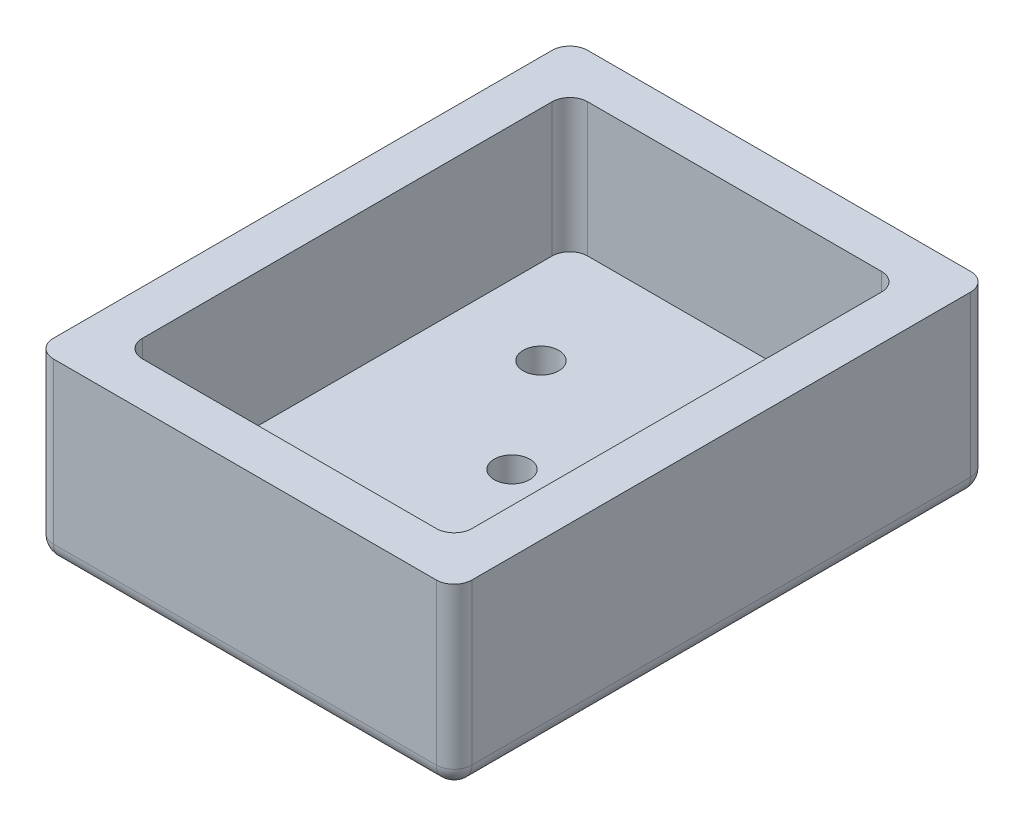
ISO-10303-21;
HEADER;
FILE_DESCRIPTION(('STEP AP214'),'2;1');
FILE_NAME('part.step','',(''),(''),'','','');
FILE_SCHEMA(('AUTOMOTIVE_DESIGN { 1 0 10303 214 1 1 1 1 }'));
ENDSEC;
DATA;
#1=APPLICATION_CONTEXT('core data for automotive mechanical design processes');
#2=APPLICATION_PROTOCOL_DEFINITION('international standard','automotive_design',2000,#1);
#3=PRODUCT_CONTEXT('',#1,'mechanical');
#4=PRODUCT('Part','Part','',(#3));
#5=PRODUCT_RELATED_PRODUCT_CATEGORY('part','',(#4));
#6=PRODUCT_DEFINITION_FORMATION('','',#4);
#7=PRODUCT_DEFINITION_CONTEXT('part definition',#1,'design');
#8=PRODUCT_DEFINITION('design','',#6,#7);
#9=PRODUCT_DEFINITION_SHAPE('','',#8);
#10=(LENGTH_UNIT() NAMED_UNIT(*) SI_UNIT(.MILLI.,.METRE.));
#11=(NAMED_UNIT(*) PLANE_ANGLE_UNIT() SI_UNIT($,.RADIAN.));
#12=(NAMED_UNIT(*) SI_UNIT($,.STERADIAN.) SOLID_ANGLE_UNIT());
#13=UNCERTAINTY_MEASURE_WITH_UNIT(LENGTH_MEASURE(1.E-05),#10,'distance_accuracy_value','');
#14=(GEOMETRIC_REPRESENTATION_CONTEXT(3) GLOBAL_UNCERTAINTY_ASSIGNED_CONTEXT((#13)) GLOBAL_UNIT_ASSIGNED_CONTEXT((#10,
#11,#12)) REPRESENTATION_CONTEXT('',''));
#15=CARTESIAN_POINT('',(0.,0.,0.));
#16=DIRECTION('',(0.,0.,1.));
#17=DIRECTION('',(1.,0.,0.));
#18=AXIS2_PLACEMENT_3D('',#15,#16,#17);
#19=CARTESIAN_POINT('',(24.1764705882353,2.,-25.427807486631));
#20=DIRECTION('',(0.,0.,1.));
#21=DIRECTION('',(1.,0.,0.));
#22=AXIS2_PLACEMENT_3D('',#19,#20,#21);
#23=CYLINDRICAL_SURFACE('',#22,2.);
#24=CARTESIAN_POINT('',(24.1764705882353,2.,-23.427807486631));
#25=DIRECTION('',(0.,0.,-1.));
#26=DIRECTION('',(-1.,0.,0.));
#27=AXIS2_PLACEMENT_3D('',#24,#25,#26);
#28=CIRCLE('',#27,2.);
#29=CARTESIAN_POINT('',(26.1764705882353,2.,-23.427807486631));
#30=VERTEX_POINT('',#29);
#31=CARTESIAN_POINT('',(24.1764705882353,0.,-23.427807486631));
#32=VERTEX_POINT('',#31);
#33=EDGE_CURVE('E11',#30,#32,#28,.T.);
#34=ORIENTED_EDGE('',*,*,#33,.F.);
#35=DIRECTION('',(0.,0.,-1.));
#36=VECTOR('',#35,1.);
#37=CARTESIAN_POINT('',(26.1764705882353,2.,-25.427807486631));
#38=LINE('',#37,#36);
#39=CARTESIAN_POINT('',(26.1764705882353,2.,32.572192513369));
#40=VERTEX_POINT('',#39);
#41=EDGE_CURVE('E359',#40,#30,#38,.T.);
#42=ORIENTED_EDGE('',*,*,#41,.F.);
#43=CARTESIAN_POINT('',(24.1764705882353,2.,32.572192513369));
#44=DIRECTION('',(0.,0.,-1.));
#45=DIRECTION('',(-1.,0.,0.));
#46=AXIS2_PLACEMENT_3D('',#43,#44,#45);
#47=CIRCLE('',#46,2.);
#48=CARTESIAN_POINT('',(24.1764705882353,0.,32.572192513369));
#49=VERTEX_POINT('',#48);
#50=EDGE_CURVE('E47',#40,#49,#47,.T.);
#51=ORIENTED_EDGE('',*,*,#50,.T.);
#52=DIRECTION('',(0.,0.,-1.));
#53=VECTOR('',#52,1.);
#54=CARTESIAN_POINT('',(24.1764705882353,0.,-25.427807486631));
#55=LINE('',#54,#53);
#56=EDGE_CURVE('E323',#32,#49,#55,.F.);
#57=ORIENTED_EDGE('',*,*,#56,.F.);
#58=EDGE_LOOP('',(#34,#42,#51,#57));
#59=FACE_BOUND('',#58,.T.);
#60=ADVANCED_FACE('F38',(#59),#23,.T.);
#61=CARTESIAN_POINT('',(24.1764705882353,2.,32.572192513369));
#62=DIRECTION('',(0.,-1.,0.));
#63=DIRECTION('',(0.,0.,-1.));
#64=AXIS2_PLACEMENT_3D('',#61,#62,#63);
#65=SPHERICAL_SURFACE('',#64,2.);
#66=ORIENTED_EDGE('',*,*,#50,.F.);
#67=CARTESIAN_POINT('',(24.1764705882353,2.,32.572192513369));
#68=DIRECTION('',(0.,1.,0.));
#69=DIRECTION('',(0.,0.,1.));
#70=AXIS2_PLACEMENT_3D('',#67,#68,#69);
#71=CIRCLE('',#70,2.);
#72=CARTESIAN_POINT('',(24.1764705882353,2.,34.572192513369));
#73=VERTEX_POINT('',#72);
#74=EDGE_CURVE('E355',#73,#40,#71,.T.);
#75=ORIENTED_EDGE('',*,*,#74,.F.);
#76=CARTESIAN_POINT('',(24.1764705882353,2.,32.572192513369));
#77=DIRECTION('',(1.,0.,0.));
#78=DIRECTION('',(0.,0.,-1.));
#79=AXIS2_PLACEMENT_3D('',#76,#77,#78);
#80=CIRCLE('',#79,2.);
#81=EDGE_CURVE('E61',#73,#49,#80,.T.);
#82=ORIENTED_EDGE('',*,*,#81,.T.);
#83=EDGE_LOOP('',(#66,#75,#82));
#84=FACE_BOUND('',#83,.T.);
#85=ADVANCED_FACE('F421',(#84),#65,.T.);
#86=CARTESIAN_POINT('',(-20.8235294117647,2.,32.572192513369));
#87=DIRECTION('',(-1.,0.,0.));
#88=DIRECTION('',(0.,0.,1.));
#89=AXIS2_PLACEMENT_3D('',#86,#87,#88);
#90=CYLINDRICAL_SURFACE('',#89,2.);
#91=ORIENTED_EDGE('',*,*,#81,.F.);
#92=DIRECTION('',(1.,0.,0.));
#93=VECTOR('',#92,1.);
#94=CARTESIAN_POINT('',(-20.8235294117647,2.,34.572192513369));
#95=LINE('',#94,#93);
#96=CARTESIAN_POINT('',(-18.8235294117647,2.,34.572192513369));
#97=VERTEX_POINT('',#96);
#98=EDGE_CURVE('E351',#97,#73,#95,.T.);
#99=ORIENTED_EDGE('',*,*,#98,.F.);
#100=CARTESIAN_POINT('',(-18.8235294117647,2.,32.572192513369));
#101=DIRECTION('',(1.,0.,0.));
#102=DIRECTION('',(0.,0.,-1.));
#103=AXIS2_PLACEMENT_3D('',#100,#101,#102);
#104=CIRCLE('',#103,2.);
#105=CARTESIAN_POINT('',(-18.8235294117647,0.,32.572192513369));
#106=VERTEX_POINT('',#105);
#107=EDGE_CURVE('E378',#97,#106,#104,.T.);
#108=ORIENTED_EDGE('',*,*,#107,.T.);
#109=DIRECTION('',(1.,0.,0.));
#110=VECTOR('',#109,1.);
#111=CARTESIAN_POINT('',(-20.8235294117647,0.,32.572192513369));
#112=LINE('',#111,#110);
#113=EDGE_CURVE('E327',#49,#106,#112,.F.);
#114=ORIENTED_EDGE('',*,*,#113,.F.);
#115=EDGE_LOOP('',(#91,#99,#108,#114));
#116=FACE_BOUND('',#115,.T.);
#117=ADVANCED_FACE('F427',(#116),#90,.T.);
#118=CARTESIAN_POINT('',(-18.8235294117647,2.,32.572192513369));
#119=DIRECTION('',(0.,-1.,0.));
#120=DIRECTION('',(0.,0.,-1.));
#121=AXIS2_PLACEMENT_3D('',#118,#119,#120);
#122=SPHERICAL_SURFACE('',#121,2.);
#123=ORIENTED_EDGE('',*,*,#107,.F.);
#124=CARTESIAN_POINT('',(-18.8235294117647,2.,32.572192513369));
#125=DIRECTION('',(0.,1.,0.));
#126=DIRECTION('',(0.,0.,1.));
#127=AXIS2_PLACEMENT_3D('',#124,#125,#126);
#128=CIRCLE('',#127,2.);
#129=CARTESIAN_POINT('',(-20.8235294117647,2.,32.572192513369));
#130=VERTEX_POINT('',#129);
#131=EDGE_CURVE('E347',#130,#97,#128,.T.);
#132=ORIENTED_EDGE('',*,*,#131,.F.);
#133=CARTESIAN_POINT('',(-18.8235294117647,2.,32.572192513369));
#134=DIRECTION('',(0.,0.,1.));
#135=DIRECTION('',(1.,0.,0.));
#136=AXIS2_PLACEMENT_3D('',#133,#134,#135);
#137=CIRCLE('',#136,2.);
#138=EDGE_CURVE('E374',#130,#106,#137,.T.);
#139=ORIENTED_EDGE('',*,*,#138,.T.);
#140=EDGE_LOOP('',(#123,#132,#139));
#141=FACE_BOUND('',#140,.T.);
#142=ADVANCED_FACE('F460',(#141),#122,.T.);
#143=CARTESIAN_POINT('',(-18.8235294117647,2.,-25.427807486631));
#144=DIRECTION('',(0.,0.,-1.));
#145=DIRECTION('',(-1.,0.,0.));
#146=AXIS2_PLACEMENT_3D('',#143,#144,#145);
#147=CYLINDRICAL_SURFACE('',#146,2.);
#148=ORIENTED_EDGE('',*,*,#138,.F.);
#149=DIRECTION('',(0.,0.,1.));
#150=VECTOR('',#149,1.);
#151=CARTESIAN_POINT('',(-20.8235294117647,2.,-25.427807486631));
#152=LINE('',#151,#150);
#153=CARTESIAN_POINT('',(-20.8235294117647,2.,-23.427807486631));
#154=VERTEX_POINT('',#153);
#155=EDGE_CURVE('E343',#154,#130,#152,.T.);
#156=ORIENTED_EDGE('',*,*,#155,.F.);
#157=CARTESIAN_POINT('',(-18.8235294117647,2.,-23.427807486631));
#158=DIRECTION('',(0.,0.,1.));
#159=DIRECTION('',(1.,0.,0.));
#160=AXIS2_PLACEMENT_3D('',#157,#158,#159);
#161=CIRCLE('',#160,2.);
#162=CARTESIAN_POINT('',(-18.8235294117647,0.,-23.427807486631));
#163=VERTEX_POINT('',#162);
#164=EDGE_CURVE('E371',#154,#163,#161,.T.);
#165=ORIENTED_EDGE('',*,*,#164,.T.);
#166=DIRECTION('',(0.,0.,1.));
#167=VECTOR('',#166,1.);
#168=CARTESIAN_POINT('',(-18.8235294117647,0.,-25.427807486631));
#169=LINE('',#168,#167);
#170=EDGE_CURVE('E331',#106,#163,#169,.F.);
#171=ORIENTED_EDGE('',*,*,#170,.F.);
#172=EDGE_LOOP('',(#148,#156,#165,#171));
#173=FACE_BOUND('',#172,.T.);
#174=ADVANCED_FACE('F468',(#173),#147,.T.);
#175=CARTESIAN_POINT('',(-18.8235294117647,2.,-23.427807486631));
#176=DIRECTION('',(0.,-1.,0.));
#177=DIRECTION('',(0.,0.,-1.));
#178=AXIS2_PLACEMENT_3D('',#175,#176,#177);
#179=SPHERICAL_SURFACE('',#178,2.);
#180=ORIENTED_EDGE('',*,*,#164,.F.);
#181=CARTESIAN_POINT('',(-18.8235294117647,2.,-23.427807486631));
#182=DIRECTION('',(0.,1.,0.));
#183=DIRECTION('',(0.,0.,1.));
#184=AXIS2_PLACEMENT_3D('',#181,#182,#183);
#185=CIRCLE('',#184,2.);
#186=CARTESIAN_POINT('',(-18.8235294117647,2.,-25.427807486631));
#187=VERTEX_POINT('',#186);
#188=EDGE_CURVE('E339',#187,#154,#185,.T.);
#189=ORIENTED_EDGE('',*,*,#188,.F.);
#190=CARTESIAN_POINT('',(-18.8235294117647,2.,-23.427807486631));
#191=DIRECTION('',(-1.,0.,0.));
#192=DIRECTION('',(0.,0.,1.));
#193=AXIS2_PLACEMENT_3D('',#190,#191,#192);
#194=CIRCLE('',#193,2.);
#195=EDGE_CURVE('E367',#187,#163,#194,.T.);
#196=ORIENTED_EDGE('',*,*,#195,.T.);
#197=EDGE_LOOP('',(#180,#189,#196));
#198=FACE_BOUND('',#197,.T.);
#199=ADVANCED_FACE('F475',(#198),#179,.T.);
#200=CARTESIAN_POINT('',(-20.8235294117647,2.,-23.427807486631));
#201=DIRECTION('',(1.,0.,0.));
#202=DIRECTION('',(0.,0.,-1.));
#203=AXIS2_PLACEMENT_3D('',#200,#201,#202);
#204=CYLINDRICAL_SURFACE('',#203,2.);
#205=ORIENTED_EDGE('',*,*,#195,.F.);
#206=DIRECTION('',(-1.,0.,0.));
#207=VECTOR('',#206,1.);
#208=CARTESIAN_POINT('',(-20.8235294117647,2.,-25.427807486631));
#209=LINE('',#208,#207);
#210=CARTESIAN_POINT('',(24.1764705882353,2.,-25.427807486631));
#211=VERTEX_POINT('',#210);
#212=EDGE_CURVE('E319',#211,#187,#209,.T.);
#213=ORIENTED_EDGE('',*,*,#212,.F.);
#214=CARTESIAN_POINT('',(24.1764705882353,2.,-23.427807486631));
#215=DIRECTION('',(-1.,0.,0.));
#216=DIRECTION('',(0.,0.,1.));
#217=AXIS2_PLACEMENT_3D('',#214,#215,#216);
#218=CIRCLE('',#217,2.);
#219=EDGE_CURVE('E363',#211,#32,#218,.T.);
#220=ORIENTED_EDGE('',*,*,#219,.T.);
#221=DIRECTION('',(-1.,0.,0.));
#222=VECTOR('',#221,1.);
#223=CARTESIAN_POINT('',(-20.8235294117647,0.,-23.427807486631));
#224=LINE('',#223,#222);
#225=EDGE_CURVE('E335',#163,#32,#224,.F.);
#226=ORIENTED_EDGE('',*,*,#225,.F.);
#227=EDGE_LOOP('',(#205,#213,#220,#226));
#228=FACE_BOUND('',#227,.T.);
#229=ADVANCED_FACE('F480',(#228),#204,.T.);
#230=CARTESIAN_POINT('',(24.1764705882353,2.,-23.427807486631));
#231=DIRECTION('',(0.,-1.,0.));
#232=DIRECTION('',(0.,0.,-1.));
#233=AXIS2_PLACEMENT_3D('',#230,#231,#232);
#234=SPHERICAL_SURFACE('',#233,2.);
#235=CARTESIAN_POINT('',(24.1764705882353,2.,-23.427807486631));
#236=DIRECTION('',(0.,1.,0.));
#237=DIRECTION('',(0.,0.,1.));
#238=AXIS2_PLACEMENT_3D('',#235,#236,#237);
#239=CIRCLE('',#238,2.);
#240=EDGE_CURVE('E315',#30,#211,#239,.T.);
#241=ORIENTED_EDGE('',*,*,#240,.F.);
#242=ORIENTED_EDGE('',*,*,#33,.T.);
#243=ORIENTED_EDGE('',*,*,#219,.F.);
#244=EDGE_LOOP('',(#241,#242,#243));
#245=FACE_BOUND('',#244,.T.);
#246=ADVANCED_FACE('F437',(#245),#234,.T.);
#247=CARTESIAN_POINT('',(24.1764705882353,20.,-23.427807486631));
#248=DIRECTION('',(0.,1.,0.));
#249=DIRECTION('',(0.,0.,1.));
#250=AXIS2_PLACEMENT_3D('',#247,#248,#249);
#251=CYLINDRICAL_SURFACE('',#250,2.);
#252=DIRECTION('',(0.,1.,0.));
#253=VECTOR('',#252,1.);
#254=CARTESIAN_POINT('',(26.1764705882353,20.,-23.427807486631));
#255=LINE('',#254,#253);
#256=CARTESIAN_POINT('',(26.1764705882353,20.,-23.427807486631));
#257=VERTEX_POINT('',#256);
#258=EDGE_CURVE('E305',#30,#257,#255,.T.);
#259=ORIENTED_EDGE('',*,*,#258,.F.);
#260=ORIENTED_EDGE('',*,*,#240,.T.);
#261=DIRECTION('',(0.,1.,0.));
#262=VECTOR('',#261,1.);
#263=CARTESIAN_POINT('',(24.1764705882353,20.,-25.427807486631));
#264=LINE('',#263,#262);
#265=CARTESIAN_POINT('',(24.1764705882353,20.,-25.427807486631));
#266=VERTEX_POINT('',#265);
#267=EDGE_CURVE('E308',#266,#211,#264,.F.);
#268=ORIENTED_EDGE('',*,*,#267,.F.);
#269=CARTESIAN_POINT('',(24.1764705882353,20.,-23.427807486631));
#270=DIRECTION('',(0.,-1.,0.));
#271=DIRECTION('',(0.,0.,-1.));
#272=AXIS2_PLACEMENT_3D('',#269,#270,#271);
#273=CIRCLE('',#272,2.);
#274=EDGE_CURVE('E312',#257,#266,#273,.F.);
#275=ORIENTED_EDGE('',*,*,#274,.F.);
#276=EDGE_LOOP('',(#259,#260,#268,#275));
#277=FACE_BOUND('',#276,.T.);
#278=ADVANCED_FACE('F441',(#277),#251,.T.);
#279=CARTESIAN_POINT('',(-18.8235294117647,20.,-23.427807486631));
#280=DIRECTION('',(0.,1.,0.));
#281=DIRECTION('',(0.,0.,1.));
#282=AXIS2_PLACEMENT_3D('',#279,#280,#281);
#283=CYLINDRICAL_SURFACE('',#282,2.);
#284=DIRECTION('',(0.,1.,0.));
#285=VECTOR('',#284,1.);
#286=CARTESIAN_POINT('',(-18.8235294117647,20.,-25.427807486631));
#287=LINE('',#286,#285);
#288=CARTESIAN_POINT('',(-18.8235294117647,20.,-25.427807486631));
#289=VERTEX_POINT('',#288);
#290=EDGE_CURVE('E295',#187,#289,#287,.T.);
#291=ORIENTED_EDGE('',*,*,#290,.F.);
#292=ORIENTED_EDGE('',*,*,#188,.T.);
#293=DIRECTION('',(0.,1.,0.));
#294=VECTOR('',#293,1.);
#295=CARTESIAN_POINT('',(-20.8235294117647,20.,-23.427807486631));
#296=LINE('',#295,#294);
#297=CARTESIAN_POINT('',(-20.8235294117647,20.,-23.427807486631));
#298=VERTEX_POINT('',#297);
#299=EDGE_CURVE('E298',#298,#154,#296,.F.);
#300=ORIENTED_EDGE('',*,*,#299,.F.);
#301=CARTESIAN_POINT('',(-18.8235294117647,20.,-23.427807486631));
#302=DIRECTION('',(0.,-1.,0.));
#303=DIRECTION('',(0.,0.,-1.));
#304=AXIS2_PLACEMENT_3D('',#301,#302,#303);
#305=CIRCLE('',#304,2.);
#306=EDGE_CURVE('E302',#289,#298,#305,.F.);
#307=ORIENTED_EDGE('',*,*,#306,.F.);
#308=EDGE_LOOP('',(#291,#292,#300,#307));
#309=FACE_BOUND('',#308,.T.);
#310=ADVANCED_FACE('F472',(#309),#283,.T.);
#311=CARTESIAN_POINT('',(24.1764705882353,20.,32.572192513369));
#312=DIRECTION('',(0.,1.,0.));
#313=DIRECTION('',(0.,0.,1.));
#314=AXIS2_PLACEMENT_3D('',#311,#312,#313);
#315=CYLINDRICAL_SURFACE('',#314,2.);
#316=DIRECTION('',(0.,1.,0.));
#317=VECTOR('',#316,1.);
#318=CARTESIAN_POINT('',(24.1764705882353,20.,34.572192513369));
#319=LINE('',#318,#317);
#320=CARTESIAN_POINT('',(24.1764705882353,20.,34.572192513369));
#321=VERTEX_POINT('',#320);
#322=EDGE_CURVE('E285',#73,#321,#319,.T.);
#323=ORIENTED_EDGE('',*,*,#322,.F.);
#324=ORIENTED_EDGE('',*,*,#74,.T.);
#325=DIRECTION('',(0.,1.,0.));
#326=VECTOR('',#325,1.);
#327=CARTESIAN_POINT('',(26.1764705882353,20.,32.572192513369));
#328=LINE('',#327,#326);
#329=CARTESIAN_POINT('',(26.1764705882353,20.,32.572192513369));
#330=VERTEX_POINT('',#329);
#331=EDGE_CURVE('E288',#330,#40,#328,.F.);
#332=ORIENTED_EDGE('',*,*,#331,.F.);
#333=CARTESIAN_POINT('',(24.1764705882353,20.,32.572192513369));
#334=DIRECTION('',(0.,-1.,0.));
#335=DIRECTION('',(0.,0.,-1.));
#336=AXIS2_PLACEMENT_3D('',#333,#334,#335);
#337=CIRCLE('',#336,2.);
#338=EDGE_CURVE('E292',#321,#330,#337,.F.);
#339=ORIENTED_EDGE('',*,*,#338,.F.);
#340=EDGE_LOOP('',(#323,#324,#332,#339));
#341=FACE_BOUND('',#340,.T.);
#342=ADVANCED_FACE('F450',(#341),#315,.T.);
#343=CARTESIAN_POINT('',(-18.8235294117647,20.,32.572192513369));
#344=DIRECTION('',(0.,1.,0.));
#345=DIRECTION('',(0.,0.,1.));
#346=AXIS2_PLACEMENT_3D('',#343,#344,#345);
#347=CYLINDRICAL_SURFACE('',#346,2.);
#348=DIRECTION('',(0.,1.,0.));
#349=VECTOR('',#348,1.);
#350=CARTESIAN_POINT('',(-20.8235294117647,20.,32.572192513369));
#351=LINE('',#350,#349);
#352=CARTESIAN_POINT('',(-20.8235294117647,20.,32.572192513369));
#353=VERTEX_POINT('',#352);
#354=EDGE_CURVE('E275',#130,#353,#351,.T.);
#355=ORIENTED_EDGE('',*,*,#354,.F.);
#356=ORIENTED_EDGE('',*,*,#131,.T.);
#357=DIRECTION('',(0.,1.,0.));
#358=VECTOR('',#357,1.);
#359=CARTESIAN_POINT('',(-18.8235294117647,20.,34.572192513369));
#360=LINE('',#359,#358);
#361=CARTESIAN_POINT('',(-18.8235294117647,20.,34.572192513369));
#362=VERTEX_POINT('',#361);
#363=EDGE_CURVE('E278',#362,#97,#360,.F.);
#364=ORIENTED_EDGE('',*,*,#363,.F.);
#365=CARTESIAN_POINT('',(-18.8235294117647,20.,32.572192513369));
#366=DIRECTION('',(0.,-1.,0.));
#367=DIRECTION('',(0.,0.,-1.));
#368=AXIS2_PLACEMENT_3D('',#365,#366,#367);
#369=CIRCLE('',#368,2.);
#370=EDGE_CURVE('E282',#353,#362,#369,.F.);
#371=ORIENTED_EDGE('',*,*,#370,.F.);
#372=EDGE_LOOP('',(#355,#356,#364,#371));
#373=FACE_BOUND('',#372,.T.);
#374=ADVANCED_FACE('F457',(#373),#347,.T.);
#375=CARTESIAN_POINT('',(19.1764705882353,20.,-18.427807486631));
#376=DIRECTION('',(0.,-1.,0.));
#377=DIRECTION('',(0.,0.,-1.));
#378=AXIS2_PLACEMENT_3D('',#375,#376,#377);
#379=CYLINDRICAL_SURFACE('',#378,2.);
#380=DIRECTION('',(0.,1.,0.));
#381=VECTOR('',#380,1.);
#382=CARTESIAN_POINT('',(19.1764705882353,20.,-20.427807486631));
#383=LINE('',#382,#381);
#384=CARTESIAN_POINT('',(19.1764705882353,5.,-20.427807486631));
#385=VERTEX_POINT('',#384);
#386=CARTESIAN_POINT('',(19.1764705882353,20.,-20.427807486631));
#387=VERTEX_POINT('',#386);
#388=EDGE_CURVE('E263',#385,#387,#383,.T.);
#389=ORIENTED_EDGE('',*,*,#388,.F.);
#390=CARTESIAN_POINT('',(19.1764705882353,5.,-18.427807486631));
#391=DIRECTION('',(0.,-1.,0.));
#392=DIRECTION('',(0.,0.,-1.));
#393=AXIS2_PLACEMENT_3D('',#390,#391,#392);
#394=CIRCLE('',#393,2.);
#395=CARTESIAN_POINT('',(21.1764705882353,5.,-18.427807486631));
#396=VERTEX_POINT('',#395);
#397=EDGE_CURVE('E269',#396,#385,#394,.F.);
#398=ORIENTED_EDGE('',*,*,#397,.F.);
#399=DIRECTION('',(0.,1.,0.));
#400=VECTOR('',#399,1.);
#401=CARTESIAN_POINT('',(21.1764705882353,20.,-18.427807486631));
#402=LINE('',#401,#400);
#403=CARTESIAN_POINT('',(21.1764705882353,20.,-18.427807486631));
#404=VERTEX_POINT('',#403);
#405=EDGE_CURVE('E191',#404,#396,#402,.F.);
#406=ORIENTED_EDGE('',*,*,#405,.F.);
#407=CARTESIAN_POINT('',(19.1764705882353,20.,-18.427807486631));
#408=DIRECTION('',(0.,-1.,0.));
#409=DIRECTION('',(0.,0.,-1.));
#410=AXIS2_PLACEMENT_3D('',#407,#408,#409);
#411=CIRCLE('',#410,2.);
#412=EDGE_CURVE('E272',#404,#387,#411,.F.);
#413=ORIENTED_EDGE('',*,*,#412,.T.);
#414=EDGE_LOOP('',(#389,#398,#406,#413));
#415=FACE_BOUND('',#414,.T.);
#416=ADVANCED_FACE('F512',(#415),#379,.F.);
#417=CARTESIAN_POINT('',(-13.8235294117647,20.,-18.427807486631));
#418=DIRECTION('',(0.,1.,0.));
#419=DIRECTION('',(0.,0.,1.));
#420=AXIS2_PLACEMENT_3D('',#417,#418,#419);
#421=CYLINDRICAL_SURFACE('',#420,2.);
#422=DIRECTION('',(0.,-1.,0.));
#423=VECTOR('',#422,1.);
#424=CARTESIAN_POINT('',(-13.8235294117647,20.,-20.427807486631));
#425=LINE('',#424,#423);
#426=CARTESIAN_POINT('',(-13.8235294117647,20.,-20.427807486631));
#427=VERTEX_POINT('',#426);
#428=CARTESIAN_POINT('',(-13.8235294117647,5.,-20.427807486631));
#429=VERTEX_POINT('',#428);
#430=EDGE_CURVE('E249',#427,#429,#425,.T.);
#431=ORIENTED_EDGE('',*,*,#430,.F.);
#432=CARTESIAN_POINT('',(-13.8235294117647,20.,-18.427807486631));
#433=DIRECTION('',(0.,-1.,0.));
#434=DIRECTION('',(0.,0.,-1.));
#435=AXIS2_PLACEMENT_3D('',#432,#433,#434);
#436=CIRCLE('',#435,2.);
#437=CARTESIAN_POINT('',(-15.8235294117647,20.,-18.427807486631));
#438=VERTEX_POINT('',#437);
#439=EDGE_CURVE('E260',#427,#438,#436,.F.);
#440=ORIENTED_EDGE('',*,*,#439,.T.);
#441=DIRECTION('',(0.,-1.,0.));
#442=VECTOR('',#441,1.);
#443=CARTESIAN_POINT('',(-15.8235294117647,20.,-18.427807486631));
#444=LINE('',#443,#442);
#445=CARTESIAN_POINT('',(-15.8235294117647,5.,-18.427807486631));
#446=VERTEX_POINT('',#445);
#447=EDGE_CURVE('E253',#446,#438,#444,.F.);
#448=ORIENTED_EDGE('',*,*,#447,.F.);
#449=CARTESIAN_POINT('',(-13.8235294117647,5.,-18.427807486631));
#450=DIRECTION('',(0.,-1.,0.));
#451=DIRECTION('',(0.,0.,-1.));
#452=AXIS2_PLACEMENT_3D('',#449,#450,#451);
#453=CIRCLE('',#452,2.);
#454=EDGE_CURVE('E257',#429,#446,#453,.F.);
#455=ORIENTED_EDGE('',*,*,#454,.F.);
#456=EDGE_LOOP('',(#431,#440,#448,#455));
#457=FACE_BOUND('',#456,.T.);
#458=ADVANCED_FACE('F508',(#457),#421,.F.);
#459=CARTESIAN_POINT('',(-13.8235294117647,20.,27.572192513369));
#460=DIRECTION('',(0.,-1.,0.));
#461=DIRECTION('',(0.,0.,-1.));
#462=AXIS2_PLACEMENT_3D('',#459,#460,#461);
#463=CYLINDRICAL_SURFACE('',#462,2.);
#464=DIRECTION('',(0.,1.,0.));
#465=VECTOR('',#464,1.);
#466=CARTESIAN_POINT('',(-13.8235294117647,20.,29.572192513369));
#467=LINE('',#466,#465);
#468=CARTESIAN_POINT('',(-13.8235294117647,5.,29.572192513369));
#469=VERTEX_POINT('',#468);
#470=CARTESIAN_POINT('',(-13.8235294117647,20.,29.572192513369));
#471=VERTEX_POINT('',#470);
#472=EDGE_CURVE('E235',#469,#471,#467,.T.);
#473=ORIENTED_EDGE('',*,*,#472,.F.);
#474=CARTESIAN_POINT('',(-13.8235294117647,5.,27.572192513369));
#475=DIRECTION('',(0.,-1.,0.));
#476=DIRECTION('',(0.,0.,-1.));
#477=AXIS2_PLACEMENT_3D('',#474,#475,#476);
#478=CIRCLE('',#477,2.);
#479=CARTESIAN_POINT('',(-15.8235294117647,5.,27.572192513369));
#480=VERTEX_POINT('',#479);
#481=EDGE_CURVE('E243',#480,#469,#478,.F.);
#482=ORIENTED_EDGE('',*,*,#481,.F.);
#483=DIRECTION('',(0.,1.,0.));
#484=VECTOR('',#483,1.);
#485=CARTESIAN_POINT('',(-15.8235294117647,20.,27.572192513369));
#486=LINE('',#485,#484);
#487=CARTESIAN_POINT('',(-15.8235294117647,20.,27.572192513369));
#488=VERTEX_POINT('',#487);
#489=EDGE_CURVE('E239',#488,#480,#486,.F.);
#490=ORIENTED_EDGE('',*,*,#489,.F.);
#491=CARTESIAN_POINT('',(-13.8235294117647,20.,27.572192513369));
#492=DIRECTION('',(0.,-1.,0.));
#493=DIRECTION('',(0.,0.,-1.));
#494=AXIS2_PLACEMENT_3D('',#491,#492,#493);
#495=CIRCLE('',#494,2.);
#496=EDGE_CURVE('E246',#488,#471,#495,.F.);
#497=ORIENTED_EDGE('',*,*,#496,.T.);
#498=EDGE_LOOP('',(#473,#482,#490,#497));
#499=FACE_BOUND('',#498,.T.);
#500=ADVANCED_FACE('F505',(#499),#463,.F.);
#501=CARTESIAN_POINT('',(19.1764705882353,20.,27.572192513369));
#502=DIRECTION('',(0.,-1.,0.));
#503=DIRECTION('',(0.,0.,-1.));
#504=AXIS2_PLACEMENT_3D('',#501,#502,#503);
#505=CYLINDRICAL_SURFACE('',#504,2.);
#506=DIRECTION('',(0.,1.,0.));
#507=VECTOR('',#506,1.);
#508=CARTESIAN_POINT('',(21.1764705882353,20.,27.572192513369));
#509=LINE('',#508,#507);
#510=CARTESIAN_POINT('',(21.1764705882353,5.,27.572192513369));
#511=VERTEX_POINT('',#510);
#512=CARTESIAN_POINT('',(21.1764705882353,20.,27.572192513369));
#513=VERTEX_POINT('',#512);
#514=EDGE_CURVE('E179',#511,#513,#509,.T.);
#515=ORIENTED_EDGE('',*,*,#514,.F.);
#516=CARTESIAN_POINT('',(19.1764705882353,5.,27.572192513369));
#517=DIRECTION('',(0.,-1.,0.));
#518=DIRECTION('',(0.,0.,-1.));
#519=AXIS2_PLACEMENT_3D('',#516,#517,#518);
#520=CIRCLE('',#519,2.);
#521=CARTESIAN_POINT('',(19.1764705882353,5.,29.572192513369));
#522=VERTEX_POINT('',#521);
#523=EDGE_CURVE('E164',#522,#511,#520,.F.);
#524=ORIENTED_EDGE('',*,*,#523,.F.);
#525=DIRECTION('',(0.,1.,0.));
#526=VECTOR('',#525,1.);
#527=CARTESIAN_POINT('',(19.1764705882353,20.,29.572192513369));
#528=LINE('',#527,#526);
#529=CARTESIAN_POINT('',(19.1764705882353,20.,29.572192513369));
#530=VERTEX_POINT('',#529);
#531=EDGE_CURVE('E176',#530,#522,#528,.F.);
#532=ORIENTED_EDGE('',*,*,#531,.F.);
#533=CARTESIAN_POINT('',(19.1764705882353,20.,27.572192513369));
#534=DIRECTION('',(0.,-1.,0.));
#535=DIRECTION('',(0.,0.,-1.));
#536=AXIS2_PLACEMENT_3D('',#533,#534,#535);
#537=CIRCLE('',#536,2.);
#538=EDGE_CURVE('E175',#530,#513,#537,.F.);
#539=ORIENTED_EDGE('',*,*,#538,.T.);
#540=EDGE_LOOP('',(#515,#524,#532,#539));
#541=FACE_BOUND('',#540,.T.);
#542=ADVANCED_FACE('F180',(#541),#505,.F.);
#543=CARTESIAN_POINT('',(0.,20.,0.));
#544=DIRECTION('',(0.,-1.,0.));
#545=DIRECTION('',(0.,0.,-1.));
#546=AXIS2_PLACEMENT_3D('',#543,#544,#545);
#547=PLANE('',#546);
#548=DIRECTION('',(0.,0.,-1.));
#549=VECTOR('',#548,1.);
#550=CARTESIAN_POINT('',(26.1764705882353,20.,-25.427807486631));
#551=LINE('',#550,#549);
#552=EDGE_CURVE('E220',#330,#257,#551,.T.);
#553=ORIENTED_EDGE('',*,*,#552,.T.);
#554=ORIENTED_EDGE('',*,*,#274,.T.);
#555=DIRECTION('',(-1.,0.,0.));
#556=VECTOR('',#555,1.);
#557=CARTESIAN_POINT('',(-20.8235294117647,20.,-25.427807486631));
#558=LINE('',#557,#556);
#559=EDGE_CURVE('E224',#266,#289,#558,.T.);
#560=ORIENTED_EDGE('',*,*,#559,.T.);
#561=ORIENTED_EDGE('',*,*,#306,.T.);
#562=DIRECTION('',(0.,0.,1.));
#563=VECTOR('',#562,1.);
#564=CARTESIAN_POINT('',(-20.8235294117647,20.,-25.427807486631));
#565=LINE('',#564,#563);
#566=EDGE_CURVE('E186',#298,#353,#565,.T.);
#567=ORIENTED_EDGE('',*,*,#566,.T.);
#568=ORIENTED_EDGE('',*,*,#370,.T.);
#569=DIRECTION('',(1.,0.,0.));
#570=VECTOR('',#569,1.);
#571=CARTESIAN_POINT('',(-20.8235294117647,20.,34.572192513369));
#572=LINE('',#571,#570);
#573=EDGE_CURVE('E216',#362,#321,#572,.T.);
#574=ORIENTED_EDGE('',*,*,#573,.T.);
#575=ORIENTED_EDGE('',*,*,#338,.T.);
#576=EDGE_LOOP('',(#553,#554,#560,#561,#567,#568,#574,#575));
#577=FACE_BOUND('',#576,.T.);
#578=DIRECTION('',(1.,0.,0.));
#579=VECTOR('',#578,1.);
#580=CARTESIAN_POINT('',(0.,20.,29.572192513369));
#581=LINE('',#580,#579);
#582=EDGE_CURVE('E204',#471,#530,#581,.T.);
#583=ORIENTED_EDGE('',*,*,#582,.F.);
#584=ORIENTED_EDGE('',*,*,#496,.F.);
#585=DIRECTION('',(0.,0.,1.));
#586=VECTOR('',#585,1.);
#587=CARTESIAN_POINT('',(-15.8235294117647,20.,0.));
#588=LINE('',#587,#586);
#589=EDGE_CURVE('E213',#438,#488,#588,.T.);
#590=ORIENTED_EDGE('',*,*,#589,.F.);
#591=ORIENTED_EDGE('',*,*,#439,.F.);
#592=DIRECTION('',(-1.,0.,0.));
#593=VECTOR('',#592,1.);
#594=CARTESIAN_POINT('',(0.,20.,-20.427807486631));
#595=LINE('',#594,#593);
#596=EDGE_CURVE('E210',#387,#427,#595,.T.);
#597=ORIENTED_EDGE('',*,*,#596,.F.);
#598=ORIENTED_EDGE('',*,*,#412,.F.);
#599=DIRECTION('',(0.,0.,-1.));
#600=VECTOR('',#599,1.);
#601=CARTESIAN_POINT('',(21.1764705882353,20.,0.));
#602=LINE('',#601,#600);
#603=EDGE_CURVE('E207',#513,#404,#602,.T.);
#604=ORIENTED_EDGE('',*,*,#603,.F.);
#605=ORIENTED_EDGE('',*,*,#538,.F.);
#606=EDGE_LOOP('',(#583,#584,#590,#591,#597,#598,#604,#605));
#607=FACE_BOUND('',#606,.T.);
#608=ADVANCED_FACE('F444',(#577,#607),#547,.F.);
#609=CARTESIAN_POINT('',(-20.8235294117647,20.,34.572192513369));
#610=DIRECTION('',(0.,0.,-1.));
#611=DIRECTION('',(-1.,0.,0.));
#612=AXIS2_PLACEMENT_3D('',#609,#610,#611);
#613=PLANE('',#612);
#614=ORIENTED_EDGE('',*,*,#363,.T.);
#615=ORIENTED_EDGE('',*,*,#98,.T.);
#616=ORIENTED_EDGE('',*,*,#322,.T.);
#617=ORIENTED_EDGE('',*,*,#573,.F.);
#618=EDGE_LOOP('',(#614,#615,#616,#617));
#619=FACE_BOUND('',#618,.T.);
#620=ADVANCED_FACE('F452',(#619),#613,.F.);
#621=CARTESIAN_POINT('',(26.1764705882353,20.,-25.427807486631));
#622=DIRECTION('',(-1.,0.,0.));
#623=DIRECTION('',(0.,0.,1.));
#624=AXIS2_PLACEMENT_3D('',#621,#622,#623);
#625=PLANE('',#624);
#626=ORIENTED_EDGE('',*,*,#331,.T.);
#627=ORIENTED_EDGE('',*,*,#41,.T.);
#628=ORIENTED_EDGE('',*,*,#258,.T.);
#629=ORIENTED_EDGE('',*,*,#552,.F.);
#630=EDGE_LOOP('',(#626,#627,#628,#629));
#631=FACE_BOUND('',#630,.T.);
#632=ADVANCED_FACE('F432',(#631),#625,.F.);
#633=CARTESIAN_POINT('',(-20.8235294117647,20.,-25.427807486631));
#634=DIRECTION('',(0.,0.,1.));
#635=DIRECTION('',(1.,0.,0.));
#636=AXIS2_PLACEMENT_3D('',#633,#634,#635);
#637=PLANE('',#636);
#638=ORIENTED_EDGE('',*,*,#267,.T.);
#639=ORIENTED_EDGE('',*,*,#212,.T.);
#640=ORIENTED_EDGE('',*,*,#290,.T.);
#641=ORIENTED_EDGE('',*,*,#559,.F.);
#642=EDGE_LOOP('',(#638,#639,#640,#641));
#643=FACE_BOUND('',#642,.T.);
#644=ADVANCED_FACE('F478',(#643),#637,.F.);
#645=CARTESIAN_POINT('',(-20.8235294117647,20.,-25.427807486631));
#646=DIRECTION('',(1.,0.,0.));
#647=DIRECTION('',(0.,0.,-1.));
#648=AXIS2_PLACEMENT_3D('',#645,#646,#647);
#649=PLANE('',#648);
#650=ORIENTED_EDGE('',*,*,#299,.T.);
#651=ORIENTED_EDGE('',*,*,#155,.T.);
#652=ORIENTED_EDGE('',*,*,#354,.T.);
#653=ORIENTED_EDGE('',*,*,#566,.F.);
#654=EDGE_LOOP('',(#650,#651,#652,#653));
#655=FACE_BOUND('',#654,.T.);
#656=ADVANCED_FACE('F464',(#655),#649,.F.);
#657=CARTESIAN_POINT('',(0.,0.,0.));
#658=DIRECTION('',(0.,-1.,0.));
#659=DIRECTION('',(0.,0.,-1.));
#660=AXIS2_PLACEMENT_3D('',#657,#658,#659);
#661=PLANE('',#660);
#662=CARTESIAN_POINT('',(-6.28063619295124,0.,-7.63491426781756));
#663=DIRECTION('',(0.,1.,0.));
#664=DIRECTION('',(0.,0.,1.));
#665=AXIS2_PLACEMENT_3D('',#662,#663,#664);
#666=CIRCLE('',#665,2.);
#667=CARTESIAN_POINT('',(-6.28063619295124,0.,-5.63491426781756));
#668=VERTEX_POINT('',#667);
#669=EDGE_CURVE('E389',#668,#668,#666,.T.);
#670=ORIENTED_EDGE('',*,*,#669,.T.);
#671=EDGE_LOOP('',(#670));
#672=FACE_BOUND('',#671,.T.);
#673=CARTESIAN_POINT('',(2.67647058823531,0.,4.57219251336899));
#674=DIRECTION('',(0.,1.,0.));
#675=DIRECTION('',(0.,0.,1.));
#676=AXIS2_PLACEMENT_3D('',#673,#674,#675);
#677=CIRCLE('',#676,2.);
#678=CARTESIAN_POINT('',(2.67647058823531,0.,6.57219251336899));
#679=VERTEX_POINT('',#678);
#680=EDGE_CURVE('E660',#679,#679,#677,.T.);
#681=ORIENTED_EDGE('',*,*,#680,.T.);
#682=EDGE_LOOP('',(#681));
#683=FACE_BOUND('',#682,.T.);
#684=CARTESIAN_POINT('',(11.6335773694219,0.,16.7792992945555));
#685=DIRECTION('',(0.,1.,0.));
#686=DIRECTION('',(0.,0.,1.));
#687=AXIS2_PLACEMENT_3D('',#684,#685,#686);
#688=CIRCLE('',#687,2.);
#689=CARTESIAN_POINT('',(11.6335773694219,0.,18.7792992945555));
#690=VERTEX_POINT('',#689);
#691=EDGE_CURVE('E664',#690,#690,#688,.T.);
#692=ORIENTED_EDGE('',*,*,#691,.T.);
#693=EDGE_LOOP('',(#692));
#694=FACE_BOUND('',#693,.T.);
#695=ORIENTED_EDGE('',*,*,#170,.T.);
#696=ORIENTED_EDGE('',*,*,#225,.T.);
#697=ORIENTED_EDGE('',*,*,#56,.T.);
#698=ORIENTED_EDGE('',*,*,#113,.T.);
#699=EDGE_LOOP('',(#695,#696,#697,#698));
#700=FACE_BOUND('',#699,.T.);
#701=ADVANCED_FACE('F482',(#672,#683,#694,#700),#661,.T.);
#702=CARTESIAN_POINT('',(-20.8235294117647,20.,29.572192513369));
#703=DIRECTION('',(0.,0.,-1.));
#704=DIRECTION('',(-1.,0.,0.));
#705=AXIS2_PLACEMENT_3D('',#702,#703,#704);
#706=PLANE('',#705);
#707=DIRECTION('',(1.,0.,0.));
#708=VECTOR('',#707,1.);
#709=CARTESIAN_POINT('',(0.,5.,29.572192513369));
#710=LINE('',#709,#708);
#711=EDGE_CURVE('E170',#469,#522,#710,.T.);
#712=ORIENTED_EDGE('',*,*,#711,.F.);
#713=ORIENTED_EDGE('',*,*,#472,.T.);
#714=ORIENTED_EDGE('',*,*,#582,.T.);
#715=ORIENTED_EDGE('',*,*,#531,.T.);
#716=EDGE_LOOP('',(#712,#713,#714,#715));
#717=FACE_BOUND('',#716,.T.);
#718=ADVANCED_FACE('F484',(#717),#706,.T.);
#719=CARTESIAN_POINT('',(21.1764705882353,20.,-25.427807486631));
#720=DIRECTION('',(-1.,0.,0.));
#721=DIRECTION('',(0.,0.,1.));
#722=AXIS2_PLACEMENT_3D('',#719,#720,#721);
#723=PLANE('',#722);
#724=ORIENTED_EDGE('',*,*,#603,.T.);
#725=ORIENTED_EDGE('',*,*,#405,.T.);
#726=DIRECTION('',(0.,0.,-1.));
#727=VECTOR('',#726,1.);
#728=CARTESIAN_POINT('',(21.1764705882353,5.,0.));
#729=LINE('',#728,#727);
#730=EDGE_CURVE('E168',#511,#396,#729,.T.);
#731=ORIENTED_EDGE('',*,*,#730,.F.);
#732=ORIENTED_EDGE('',*,*,#514,.T.);
#733=EDGE_LOOP('',(#724,#725,#731,#732));
#734=FACE_BOUND('',#733,.T.);
#735=ADVANCED_FACE('F189',(#734),#723,.T.);
#736=CARTESIAN_POINT('',(-20.8235294117647,20.,-20.427807486631));
#737=DIRECTION('',(0.,0.,1.));
#738=DIRECTION('',(1.,0.,0.));
#739=AXIS2_PLACEMENT_3D('',#736,#737,#738);
#740=PLANE('',#739);
#741=DIRECTION('',(-1.,0.,0.));
#742=VECTOR('',#741,1.);
#743=CARTESIAN_POINT('',(0.,5.,-20.427807486631));
#744=LINE('',#743,#742);
#745=EDGE_CURVE('E193',#385,#429,#744,.T.);
#746=ORIENTED_EDGE('',*,*,#745,.F.);
#747=ORIENTED_EDGE('',*,*,#388,.T.);
#748=ORIENTED_EDGE('',*,*,#596,.T.);
#749=ORIENTED_EDGE('',*,*,#430,.T.);
#750=EDGE_LOOP('',(#746,#747,#748,#749));
#751=FACE_BOUND('',#750,.T.);
#752=ADVANCED_FACE('F614',(#751),#740,.T.);
#753=CARTESIAN_POINT('',(-15.8235294117647,20.,-25.427807486631));
#754=DIRECTION('',(1.,0.,0.));
#755=DIRECTION('',(0.,0.,-1.));
#756=AXIS2_PLACEMENT_3D('',#753,#754,#755);
#757=PLANE('',#756);
#758=DIRECTION('',(0.,0.,1.));
#759=VECTOR('',#758,1.);
#760=CARTESIAN_POINT('',(-15.8235294117647,5.,0.));
#761=LINE('',#760,#759);
#762=EDGE_CURVE('E197',#446,#480,#761,.T.);
#763=ORIENTED_EDGE('',*,*,#762,.F.);
#764=ORIENTED_EDGE('',*,*,#447,.T.);
#765=ORIENTED_EDGE('',*,*,#589,.T.);
#766=ORIENTED_EDGE('',*,*,#489,.T.);
#767=EDGE_LOOP('',(#763,#764,#765,#766));
#768=FACE_BOUND('',#767,.T.);
#769=ADVANCED_FACE('F403',(#768),#757,.T.);
#770=CARTESIAN_POINT('',(0.,5.,0.));
#771=DIRECTION('',(0.,-1.,0.));
#772=DIRECTION('',(0.,0.,-1.));
#773=AXIS2_PLACEMENT_3D('',#770,#771,#772);
#774=PLANE('',#773);
#775=CARTESIAN_POINT('',(-6.28063619295124,5.,-7.63491426781756));
#776=DIRECTION('',(0.,-1.,0.));
#777=DIRECTION('',(0.,0.,-1.));
#778=AXIS2_PLACEMENT_3D('',#775,#776,#777);
#779=CIRCLE('',#778,2.);
#780=CARTESIAN_POINT('',(-6.28063619295124,5.,-9.63491426781756));
#781=VERTEX_POINT('',#780);
#782=EDGE_CURVE('E41',#781,#781,#779,.F.);
#783=ORIENTED_EDGE('',*,*,#782,.F.);
#784=EDGE_LOOP('',(#783));
#785=FACE_BOUND('',#784,.T.);
#786=CARTESIAN_POINT('',(2.67647058823531,5.,4.57219251336899));
#787=DIRECTION('',(0.,-1.,0.));
#788=DIRECTION('',(0.,0.,-1.));
#789=AXIS2_PLACEMENT_3D('',#786,#787,#788);
#790=CIRCLE('',#789,2.);
#791=CARTESIAN_POINT('',(2.67647058823531,5.,2.57219251336899));
#792=VERTEX_POINT('',#791);
#793=EDGE_CURVE('E388',#792,#792,#790,.F.);
#794=ORIENTED_EDGE('',*,*,#793,.F.);
#795=EDGE_LOOP('',(#794));
#796=FACE_BOUND('',#795,.T.);
#797=CARTESIAN_POINT('',(11.6335773694219,5.,16.7792992945555));
#798=DIRECTION('',(0.,-1.,0.));
#799=DIRECTION('',(0.,0.,-1.));
#800=AXIS2_PLACEMENT_3D('',#797,#798,#799);
#801=CIRCLE('',#800,2.);
#802=CARTESIAN_POINT('',(11.6335773694219,5.,14.7792992945555));
#803=VERTEX_POINT('',#802);
#804=EDGE_CURVE('E385',#803,#803,#801,.F.);
#805=ORIENTED_EDGE('',*,*,#804,.F.);
#806=EDGE_LOOP('',(#805));
#807=FACE_BOUND('',#806,.T.);
#808=ORIENTED_EDGE('',*,*,#730,.T.);
#809=ORIENTED_EDGE('',*,*,#397,.T.);
#810=ORIENTED_EDGE('',*,*,#745,.T.);
#811=ORIENTED_EDGE('',*,*,#454,.T.);
#812=ORIENTED_EDGE('',*,*,#762,.T.);
#813=ORIENTED_EDGE('',*,*,#481,.T.);
#814=ORIENTED_EDGE('',*,*,#711,.T.);
#815=ORIENTED_EDGE('',*,*,#523,.T.);
#816=EDGE_LOOP('',(#808,#809,#810,#811,#812,#813,#814,#815));
#817=FACE_BOUND('',#816,.T.);
#818=ADVANCED_FACE('F166',(#785,#796,#807,#817),#774,.F.);
#819=CARTESIAN_POINT('',(11.6335773694219,10.,16.7792992945555));
#820=DIRECTION('',(0.,-1.,0.));
#821=DIRECTION('',(0.,0.,-1.));
#822=AXIS2_PLACEMENT_3D('',#819,#820,#821);
#823=CYLINDRICAL_SURFACE('',#822,2.);
#824=ORIENTED_EDGE('',*,*,#691,.F.);
#825=EDGE_LOOP('',(#824));
#826=FACE_BOUND('',#825,.T.);
#827=ORIENTED_EDGE('',*,*,#804,.T.);
#828=EDGE_LOOP('',(#827));
#829=FACE_BOUND('',#828,.T.);
#830=ADVANCED_FACE('F402',(#826,#829),#823,.F.);
#831=CARTESIAN_POINT('',(2.67647058823531,10.,4.57219251336899));
#832=DIRECTION('',(0.,-1.,0.));
#833=DIRECTION('',(0.,0.,-1.));
#834=AXIS2_PLACEMENT_3D('',#831,#832,#833);
#835=CYLINDRICAL_SURFACE('',#834,2.);
#836=ORIENTED_EDGE('',*,*,#680,.F.);
#837=EDGE_LOOP('',(#836));
#838=FACE_BOUND('',#837,.T.);
#839=ORIENTED_EDGE('',*,*,#793,.T.);
#840=EDGE_LOOP('',(#839));
#841=FACE_BOUND('',#840,.T.);
#842=ADVANCED_FACE('F409',(#838,#841),#835,.F.);
#843=CARTESIAN_POINT('',(-6.28063619295124,10.,-7.63491426781756));
#844=DIRECTION('',(0.,-1.,0.));
#845=DIRECTION('',(0.,0.,-1.));
#846=AXIS2_PLACEMENT_3D('',#843,#844,#845);
#847=CYLINDRICAL_SURFACE('',#846,2.);
#848=ORIENTED_EDGE('',*,*,#669,.F.);
#849=EDGE_LOOP('',(#848));
#850=FACE_BOUND('',#849,.T.);
#851=ORIENTED_EDGE('',*,*,#782,.T.);
#852=EDGE_LOOP('',(#851));
#853=FACE_BOUND('',#852,.T.);
#854=ADVANCED_FACE('F398',(#850,#853),#847,.F.);
#855=CLOSED_SHELL('',(#60,#85,#117,#142,#174,#199,#229,#246,#278,#310,#342,#374,#416,#458,#500,
#542,#608,#620,#632,#644,#656,#701,#718,#735,#752,#769,#818,#830,#842,#854));
#856=MANIFOLD_SOLID_BREP('B2',#855);
#857=ADVANCED_BREP_SHAPE_REPRESENTATION('',(#18,#856),#14);
#858=SHAPE_DEFINITION_REPRESENTATION(#9,#857);
ENDSEC;
END-ISO-10303-21;
